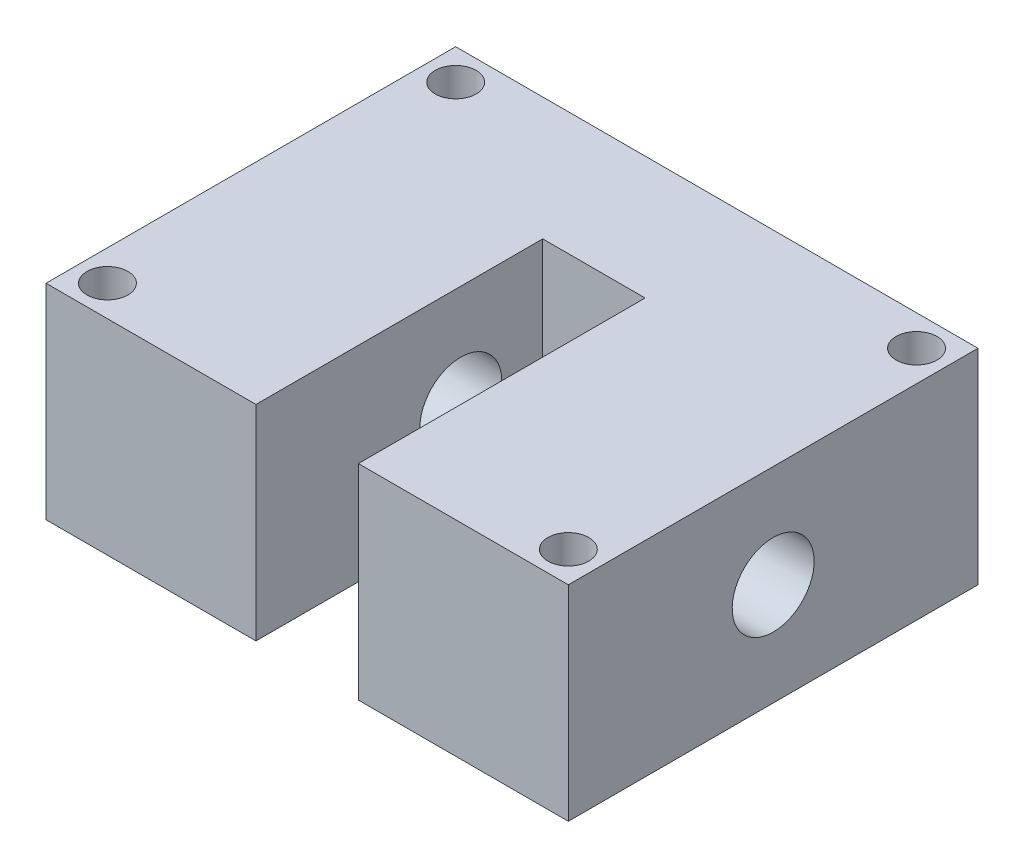
ISO-10303-21;
HEADER;
FILE_DESCRIPTION(('STEP AP214'),'2;1');
FILE_NAME('part.step','',(''),(''),'','','');
FILE_SCHEMA(('AUTOMOTIVE_DESIGN { 1 0 10303 214 1 1 1 1 }'));
ENDSEC;
DATA;
#1=APPLICATION_CONTEXT('core data for automotive mechanical design processes');
#2=APPLICATION_PROTOCOL_DEFINITION('international standard','automotive_design',2000,#1);
#3=PRODUCT_CONTEXT('',#1,'mechanical');
#4=PRODUCT('Part','Part','',(#3));
#5=PRODUCT_RELATED_PRODUCT_CATEGORY('part','',(#4));
#6=PRODUCT_DEFINITION_FORMATION('','',#4);
#7=PRODUCT_DEFINITION_CONTEXT('part definition',#1,'design');
#8=PRODUCT_DEFINITION('design','',#6,#7);
#9=PRODUCT_DEFINITION_SHAPE('','',#8);
#10=(LENGTH_UNIT() NAMED_UNIT(*) SI_UNIT(.MILLI.,.METRE.));
#11=(NAMED_UNIT(*) PLANE_ANGLE_UNIT() SI_UNIT($,.RADIAN.));
#12=(NAMED_UNIT(*) SI_UNIT($,.STERADIAN.) SOLID_ANGLE_UNIT());
#13=UNCERTAINTY_MEASURE_WITH_UNIT(LENGTH_MEASURE(1.E-05),#10,'distance_accuracy_value','');
#14=(GEOMETRIC_REPRESENTATION_CONTEXT(3) GLOBAL_UNCERTAINTY_ASSIGNED_CONTEXT((#13)) GLOBAL_UNIT_ASSIGNED_CONTEXT((#10,
#11,#12)) REPRESENTATION_CONTEXT('',''));
#15=CARTESIAN_POINT('',(0.,0.,0.));
#16=DIRECTION('',(0.,0.,1.));
#17=DIRECTION('',(1.,0.,0.));
#18=AXIS2_PLACEMENT_3D('',#15,#16,#17);
#19=CARTESIAN_POINT('',(0.,0.,20.));
#20=DIRECTION('',(0.,0.,1.));
#21=DIRECTION('',(1.,0.,0.));
#22=AXIS2_PLACEMENT_3D('',#19,#20,#21);
#23=PLANE('',#22);
#24=DIRECTION('',(0.,1.,0.));
#25=VECTOR('',#24,1.);
#26=CARTESIAN_POINT('',(5.,10.,20.));
#27=LINE('',#26,#25);
#28=CARTESIAN_POINT('',(5.,-10.,20.));
#29=VERTEX_POINT('',#28);
#30=CARTESIAN_POINT('',(5.,10.,20.));
#31=VERTEX_POINT('',#30);
#32=EDGE_CURVE('E115',#29,#31,#27,.T.);
#33=ORIENTED_EDGE('',*,*,#32,.F.);
#34=DIRECTION('',(1.,0.,0.));
#35=VECTOR('',#34,1.);
#36=CARTESIAN_POINT('',(-25.5,-10.,20.));
#37=LINE('',#36,#35);
#38=CARTESIAN_POINT('',(25.5,-10.,20.));
#39=VERTEX_POINT('',#38);
#40=EDGE_CURVE('E60',#29,#39,#37,.T.);
#41=ORIENTED_EDGE('',*,*,#40,.T.);
#42=DIRECTION('',(0.,1.,0.));
#43=VECTOR('',#42,1.);
#44=CARTESIAN_POINT('',(25.5,10.,20.));
#45=LINE('',#44,#43);
#46=CARTESIAN_POINT('',(25.5,10.,20.));
#47=VERTEX_POINT('',#46);
#48=EDGE_CURVE('E146',#39,#47,#45,.T.);
#49=ORIENTED_EDGE('',*,*,#48,.T.);
#50=DIRECTION('',(-1.,0.,0.));
#51=VECTOR('',#50,1.);
#52=CARTESIAN_POINT('',(-25.5,10.,20.));
#53=LINE('',#52,#51);
#54=EDGE_CURVE('E89',#47,#31,#53,.T.);
#55=ORIENTED_EDGE('',*,*,#54,.T.);
#56=EDGE_LOOP('',(#33,#41,#49,#55));
#57=FACE_BOUND('',#56,.T.);
#58=ADVANCED_FACE('F35',(#57),#23,.T.);
#59=CARTESIAN_POINT('',(25.5,10.,20.));
#60=DIRECTION('',(-1.,0.,0.));
#61=DIRECTION('',(0.,-1.,0.));
#62=AXIS2_PLACEMENT_3D('',#59,#60,#61);
#63=PLANE('',#62);
#64=CARTESIAN_POINT('',(25.5,0.,0.));
#65=DIRECTION('',(-1.,0.,0.));
#66=DIRECTION('',(0.,-1.,0.));
#67=AXIS2_PLACEMENT_3D('',#64,#65,#66);
#68=CIRCLE('',#67,4.);
#69=CARTESIAN_POINT('',(25.5,-4.,0.));
#70=VERTEX_POINT('',#69);
#71=EDGE_CURVE('E262',#70,#70,#68,.T.);
#72=ORIENTED_EDGE('',*,*,#71,.T.);
#73=EDGE_LOOP('',(#72));
#74=FACE_BOUND('',#73,.T.);
#75=DIRECTION('',(0.,1.,0.));
#76=VECTOR('',#75,1.);
#77=CARTESIAN_POINT('',(25.5,10.,-20.));
#78=LINE('',#77,#76);
#79=CARTESIAN_POINT('',(25.5,-10.,-20.));
#80=VERTEX_POINT('',#79);
#81=CARTESIAN_POINT('',(25.5,10.,-20.));
#82=VERTEX_POINT('',#81);
#83=EDGE_CURVE('E141',#80,#82,#78,.T.);
#84=ORIENTED_EDGE('',*,*,#83,.T.);
#85=DIRECTION('',(0.,0.,-1.));
#86=VECTOR('',#85,1.);
#87=CARTESIAN_POINT('',(25.5,10.,20.));
#88=LINE('',#87,#86);
#89=EDGE_CURVE('E11',#47,#82,#88,.T.);
#90=ORIENTED_EDGE('',*,*,#89,.F.);
#91=ORIENTED_EDGE('',*,*,#48,.F.);
#92=DIRECTION('',(0.,0.,-1.));
#93=VECTOR('',#92,1.);
#94=CARTESIAN_POINT('',(25.5,-10.,20.));
#95=LINE('',#94,#93);
#96=EDGE_CURVE('E155',#39,#80,#95,.T.);
#97=ORIENTED_EDGE('',*,*,#96,.T.);
#98=EDGE_LOOP('',(#84,#90,#91,#97));
#99=FACE_BOUND('',#98,.T.);
#100=ADVANCED_FACE('F37',(#74,#99),#63,.F.);
#101=CARTESIAN_POINT('',(-25.5,10.,20.));
#102=DIRECTION('',(0.,-1.,0.));
#103=DIRECTION('',(0.,0.,-1.));
#104=AXIS2_PLACEMENT_3D('',#101,#102,#103);
#105=PLANE('',#104);
#106=CARTESIAN_POINT('',(-22.5,10.,17.));
#107=DIRECTION('',(0.,1.,0.));
#108=DIRECTION('',(0.,0.,1.));
#109=AXIS2_PLACEMENT_3D('',#106,#107,#108);
#110=CIRCLE('',#109,2.);
#111=CARTESIAN_POINT('',(-22.5,10.,19.));
#112=VERTEX_POINT('',#111);
#113=EDGE_CURVE('E248',#112,#112,#110,.T.);
#114=ORIENTED_EDGE('',*,*,#113,.F.);
#115=EDGE_LOOP('',(#114));
#116=FACE_BOUND('',#115,.T.);
#117=CARTESIAN_POINT('',(22.5,10.,-17.));
#118=DIRECTION('',(0.,1.,0.));
#119=DIRECTION('',(0.,0.,1.));
#120=AXIS2_PLACEMENT_3D('',#117,#118,#119);
#121=CIRCLE('',#120,2.);
#122=CARTESIAN_POINT('',(22.5,10.,-15.));
#123=VERTEX_POINT('',#122);
#124=EDGE_CURVE('E241',#123,#123,#121,.T.);
#125=ORIENTED_EDGE('',*,*,#124,.F.);
#126=EDGE_LOOP('',(#125));
#127=FACE_BOUND('',#126,.T.);
#128=CARTESIAN_POINT('',(22.5,10.,17.));
#129=DIRECTION('',(0.,1.,0.));
#130=DIRECTION('',(0.,0.,1.));
#131=AXIS2_PLACEMENT_3D('',#128,#129,#130);
#132=CIRCLE('',#131,2.);
#133=CARTESIAN_POINT('',(22.5,10.,19.));
#134=VERTEX_POINT('',#133);
#135=EDGE_CURVE('E245',#134,#134,#132,.T.);
#136=ORIENTED_EDGE('',*,*,#135,.F.);
#137=EDGE_LOOP('',(#136));
#138=FACE_BOUND('',#137,.T.);
#139=CARTESIAN_POINT('',(-22.5,10.,-17.));
#140=DIRECTION('',(0.,1.,0.));
#141=DIRECTION('',(0.,0.,1.));
#142=AXIS2_PLACEMENT_3D('',#139,#140,#141);
#143=CIRCLE('',#142,2.);
#144=CARTESIAN_POINT('',(-22.5,10.,-15.));
#145=VERTEX_POINT('',#144);
#146=EDGE_CURVE('E256',#145,#145,#143,.T.);
#147=ORIENTED_EDGE('',*,*,#146,.F.);
#148=EDGE_LOOP('',(#147));
#149=FACE_BOUND('',#148,.T.);
#150=DIRECTION('',(-1.,0.,0.));
#151=VECTOR('',#150,1.);
#152=CARTESIAN_POINT('',(-5.,10.,-8.));
#153=LINE('',#152,#151);
#154=CARTESIAN_POINT('',(5.,10.,-8.));
#155=VERTEX_POINT('',#154);
#156=CARTESIAN_POINT('',(-5.,10.,-8.));
#157=VERTEX_POINT('',#156);
#158=EDGE_CURVE('E123',#155,#157,#153,.T.);
#159=ORIENTED_EDGE('',*,*,#158,.F.);
#160=DIRECTION('',(0.,0.,1.));
#161=VECTOR('',#160,1.);
#162=CARTESIAN_POINT('',(5.,10.,-8.));
#163=LINE('',#162,#161);
#164=EDGE_CURVE('E110',#155,#31,#163,.T.);
#165=ORIENTED_EDGE('',*,*,#164,.T.);
#166=ORIENTED_EDGE('',*,*,#54,.F.);
#167=ORIENTED_EDGE('',*,*,#89,.T.);
#168=DIRECTION('',(-1.,0.,0.));
#169=VECTOR('',#168,1.);
#170=CARTESIAN_POINT('',(-25.5,10.,-20.));
#171=LINE('',#170,#169);
#172=CARTESIAN_POINT('',(-25.5,10.,-20.));
#173=VERTEX_POINT('',#172);
#174=EDGE_CURVE('E158',#82,#173,#171,.T.);
#175=ORIENTED_EDGE('',*,*,#174,.T.);
#176=DIRECTION('',(0.,0.,-1.));
#177=VECTOR('',#176,1.);
#178=CARTESIAN_POINT('',(-25.5,10.,20.));
#179=LINE('',#178,#177);
#180=CARTESIAN_POINT('',(-25.5,10.,20.));
#181=VERTEX_POINT('',#180);
#182=EDGE_CURVE('E44',#181,#173,#179,.T.);
#183=ORIENTED_EDGE('',*,*,#182,.F.);
#184=CARTESIAN_POINT('',(-5.,10.,20.));
#185=VERTEX_POINT('',#184);
#186=EDGE_CURVE('E148',#185,#181,#53,.T.);
#187=ORIENTED_EDGE('',*,*,#186,.F.);
#188=DIRECTION('',(0.,0.,1.));
#189=VECTOR('',#188,1.);
#190=CARTESIAN_POINT('',(-5.,10.,-8.));
#191=LINE('',#190,#189);
#192=EDGE_CURVE('E51',#157,#185,#191,.T.);
#193=ORIENTED_EDGE('',*,*,#192,.F.);
#194=EDGE_LOOP('',(#159,#165,#166,#167,#175,#183,#187,#193));
#195=FACE_BOUND('',#194,.T.);
#196=ADVANCED_FACE('F128',(#116,#127,#138,#149,#195),#105,.F.);
#197=CARTESIAN_POINT('',(-25.5,10.,20.));
#198=DIRECTION('',(1.,0.,0.));
#199=DIRECTION('',(0.,1.,0.));
#200=AXIS2_PLACEMENT_3D('',#197,#198,#199);
#201=PLANE('',#200);
#202=CARTESIAN_POINT('',(-25.5,0.,0.));
#203=DIRECTION('',(1.,0.,0.));
#204=DIRECTION('',(0.,1.,0.));
#205=AXIS2_PLACEMENT_3D('',#202,#203,#204);
#206=CIRCLE('',#205,4.);
#207=CARTESIAN_POINT('',(-25.5,4.,0.));
#208=VERTEX_POINT('',#207);
#209=EDGE_CURVE('E137',#208,#208,#206,.T.);
#210=ORIENTED_EDGE('',*,*,#209,.T.);
#211=EDGE_LOOP('',(#210));
#212=FACE_BOUND('',#211,.T.);
#213=DIRECTION('',(0.,-1.,0.));
#214=VECTOR('',#213,1.);
#215=CARTESIAN_POINT('',(-25.5,10.,-20.));
#216=LINE('',#215,#214);
#217=CARTESIAN_POINT('',(-25.5,-10.,-20.));
#218=VERTEX_POINT('',#217);
#219=EDGE_CURVE('E160',#173,#218,#216,.T.);
#220=ORIENTED_EDGE('',*,*,#219,.T.);
#221=DIRECTION('',(0.,0.,-1.));
#222=VECTOR('',#221,1.);
#223=CARTESIAN_POINT('',(-25.5,-10.,20.));
#224=LINE('',#223,#222);
#225=CARTESIAN_POINT('',(-25.5,-10.,20.));
#226=VERTEX_POINT('',#225);
#227=EDGE_CURVE('E164',#226,#218,#224,.T.);
#228=ORIENTED_EDGE('',*,*,#227,.F.);
#229=DIRECTION('',(0.,-1.,0.));
#230=VECTOR('',#229,1.);
#231=CARTESIAN_POINT('',(-25.5,10.,20.));
#232=LINE('',#231,#230);
#233=EDGE_CURVE('E150',#181,#226,#232,.T.);
#234=ORIENTED_EDGE('',*,*,#233,.F.);
#235=ORIENTED_EDGE('',*,*,#182,.T.);
#236=EDGE_LOOP('',(#220,#228,#234,#235));
#237=FACE_BOUND('',#236,.T.);
#238=ADVANCED_FACE('F171',(#212,#237),#201,.F.);
#239=CARTESIAN_POINT('',(-25.5,-10.,20.));
#240=DIRECTION('',(0.,1.,0.));
#241=DIRECTION('',(0.,0.,1.));
#242=AXIS2_PLACEMENT_3D('',#239,#240,#241);
#243=PLANE('',#242);
#244=CARTESIAN_POINT('',(-22.5,-10.,17.));
#245=DIRECTION('',(0.,1.,0.));
#246=DIRECTION('',(0.,0.,1.));
#247=AXIS2_PLACEMENT_3D('',#244,#245,#246);
#248=CIRCLE('',#247,2.);
#249=CARTESIAN_POINT('',(-22.5,-10.,19.));
#250=VERTEX_POINT('',#249);
#251=EDGE_CURVE('E243',#250,#250,#248,.T.);
#252=ORIENTED_EDGE('',*,*,#251,.T.);
#253=EDGE_LOOP('',(#252));
#254=FACE_BOUND('',#253,.T.);
#255=CARTESIAN_POINT('',(22.5,-10.,-17.));
#256=DIRECTION('',(0.,1.,0.));
#257=DIRECTION('',(0.,0.,1.));
#258=AXIS2_PLACEMENT_3D('',#255,#256,#257);
#259=CIRCLE('',#258,2.);
#260=CARTESIAN_POINT('',(22.5,-10.,-15.));
#261=VERTEX_POINT('',#260);
#262=EDGE_CURVE('E238',#261,#261,#259,.T.);
#263=ORIENTED_EDGE('',*,*,#262,.T.);
#264=EDGE_LOOP('',(#263));
#265=FACE_BOUND('',#264,.T.);
#266=CARTESIAN_POINT('',(22.5,-10.,17.));
#267=DIRECTION('',(0.,1.,0.));
#268=DIRECTION('',(0.,0.,1.));
#269=AXIS2_PLACEMENT_3D('',#266,#267,#268);
#270=CIRCLE('',#269,2.);
#271=CARTESIAN_POINT('',(22.5,-10.,19.));
#272=VERTEX_POINT('',#271);
#273=EDGE_CURVE('E253',#272,#272,#270,.T.);
#274=ORIENTED_EDGE('',*,*,#273,.T.);
#275=EDGE_LOOP('',(#274));
#276=FACE_BOUND('',#275,.T.);
#277=CARTESIAN_POINT('',(-22.5,-10.,-17.));
#278=DIRECTION('',(0.,1.,0.));
#279=DIRECTION('',(0.,0.,1.));
#280=AXIS2_PLACEMENT_3D('',#277,#278,#279);
#281=CIRCLE('',#280,2.);
#282=CARTESIAN_POINT('',(-22.5,-10.,-15.));
#283=VERTEX_POINT('',#282);
#284=EDGE_CURVE('E259',#283,#283,#281,.T.);
#285=ORIENTED_EDGE('',*,*,#284,.T.);
#286=EDGE_LOOP('',(#285));
#287=FACE_BOUND('',#286,.T.);
#288=ORIENTED_EDGE('',*,*,#40,.F.);
#289=DIRECTION('',(0.,0.,1.));
#290=VECTOR('',#289,1.);
#291=CARTESIAN_POINT('',(5.,-10.,-8.));
#292=LINE('',#291,#290);
#293=CARTESIAN_POINT('',(5.,-10.,-8.));
#294=VERTEX_POINT('',#293);
#295=EDGE_CURVE('E139',#294,#29,#292,.T.);
#296=ORIENTED_EDGE('',*,*,#295,.F.);
#297=DIRECTION('',(1.,0.,0.));
#298=VECTOR('',#297,1.);
#299=CARTESIAN_POINT('',(-5.,-10.,-8.));
#300=LINE('',#299,#298);
#301=CARTESIAN_POINT('',(-5.,-10.,-8.));
#302=VERTEX_POINT('',#301);
#303=EDGE_CURVE('E117',#302,#294,#300,.T.);
#304=ORIENTED_EDGE('',*,*,#303,.F.);
#305=DIRECTION('',(0.,0.,1.));
#306=VECTOR('',#305,1.);
#307=CARTESIAN_POINT('',(-5.,-10.,-8.));
#308=LINE('',#307,#306);
#309=CARTESIAN_POINT('',(-5.,-10.,20.));
#310=VERTEX_POINT('',#309);
#311=EDGE_CURVE('E142',#302,#310,#308,.T.);
#312=ORIENTED_EDGE('',*,*,#311,.T.);
#313=EDGE_CURVE('E152',#226,#310,#37,.T.);
#314=ORIENTED_EDGE('',*,*,#313,.F.);
#315=ORIENTED_EDGE('',*,*,#227,.T.);
#316=DIRECTION('',(1.,0.,0.));
#317=VECTOR('',#316,1.);
#318=CARTESIAN_POINT('',(-25.5,-10.,-20.));
#319=LINE('',#318,#317);
#320=EDGE_CURVE('E82',#218,#80,#319,.T.);
#321=ORIENTED_EDGE('',*,*,#320,.T.);
#322=ORIENTED_EDGE('',*,*,#96,.F.);
#323=EDGE_LOOP('',(#288,#296,#304,#312,#314,#315,#321,#322));
#324=FACE_BOUND('',#323,.T.);
#325=ADVANCED_FACE('F179',(#254,#265,#276,#287,#324),#243,.F.);
#326=DIRECTION('',(0.,-1.,0.));
#327=VECTOR('',#326,1.);
#328=CARTESIAN_POINT('',(-5.,10.,20.));
#329=LINE('',#328,#327);
#330=EDGE_CURVE('E126',#185,#310,#329,.T.);
#331=ORIENTED_EDGE('',*,*,#330,.F.);
#332=ORIENTED_EDGE('',*,*,#186,.T.);
#333=ORIENTED_EDGE('',*,*,#233,.T.);
#334=ORIENTED_EDGE('',*,*,#313,.T.);
#335=EDGE_LOOP('',(#331,#332,#333,#334));
#336=FACE_BOUND('',#335,.T.);
#337=ADVANCED_FACE('F182',(#336),#23,.T.);
#338=CARTESIAN_POINT('',(0.,0.,-20.));
#339=DIRECTION('',(0.,0.,1.));
#340=DIRECTION('',(1.,0.,0.));
#341=AXIS2_PLACEMENT_3D('',#338,#339,#340);
#342=PLANE('',#341);
#343=ORIENTED_EDGE('',*,*,#83,.F.);
#344=ORIENTED_EDGE('',*,*,#320,.F.);
#345=ORIENTED_EDGE('',*,*,#219,.F.);
#346=ORIENTED_EDGE('',*,*,#174,.F.);
#347=EDGE_LOOP('',(#343,#344,#345,#346));
#348=FACE_BOUND('',#347,.T.);
#349=ADVANCED_FACE('F175',(#348),#342,.F.);
#350=CARTESIAN_POINT('',(5.,10.,-8.));
#351=DIRECTION('',(1.,0.,0.));
#352=DIRECTION('',(0.,1.,0.));
#353=AXIS2_PLACEMENT_3D('',#350,#351,#352);
#354=PLANE('',#353);
#355=CARTESIAN_POINT('',(5.,0.,0.));
#356=DIRECTION('',(1.,0.,0.));
#357=DIRECTION('',(0.,1.,0.));
#358=AXIS2_PLACEMENT_3D('',#355,#356,#357);
#359=CIRCLE('',#358,4.);
#360=CARTESIAN_POINT('',(5.,4.,0.));
#361=VERTEX_POINT('',#360);
#362=EDGE_CURVE('E267',#361,#361,#359,.T.);
#363=ORIENTED_EDGE('',*,*,#362,.T.);
#364=EDGE_LOOP('',(#363));
#365=FACE_BOUND('',#364,.T.);
#366=ORIENTED_EDGE('',*,*,#32,.T.);
#367=ORIENTED_EDGE('',*,*,#164,.F.);
#368=DIRECTION('',(0.,1.,0.));
#369=VECTOR('',#368,1.);
#370=CARTESIAN_POINT('',(5.,10.,-8.));
#371=LINE('',#370,#369);
#372=EDGE_CURVE('E113',#294,#155,#371,.T.);
#373=ORIENTED_EDGE('',*,*,#372,.F.);
#374=ORIENTED_EDGE('',*,*,#295,.T.);
#375=EDGE_LOOP('',(#366,#367,#373,#374));
#376=FACE_BOUND('',#375,.T.);
#377=ADVANCED_FACE('F112',(#365,#376),#354,.F.);
#378=CARTESIAN_POINT('',(-5.,10.,-8.));
#379=DIRECTION('',(-1.,0.,0.));
#380=DIRECTION('',(0.,-1.,0.));
#381=AXIS2_PLACEMENT_3D('',#378,#379,#380);
#382=PLANE('',#381);
#383=CARTESIAN_POINT('',(-5.,0.,0.));
#384=DIRECTION('',(-1.,0.,0.));
#385=DIRECTION('',(0.,-1.,0.));
#386=AXIS2_PLACEMENT_3D('',#383,#384,#385);
#387=CIRCLE('',#386,4.);
#388=CARTESIAN_POINT('',(-5.,-4.,0.));
#389=VERTEX_POINT('',#388);
#390=EDGE_CURVE('E39',#389,#389,#387,.T.);
#391=ORIENTED_EDGE('',*,*,#390,.T.);
#392=EDGE_LOOP('',(#391));
#393=FACE_BOUND('',#392,.T.);
#394=ORIENTED_EDGE('',*,*,#330,.T.);
#395=ORIENTED_EDGE('',*,*,#311,.F.);
#396=DIRECTION('',(0.,-1.,0.));
#397=VECTOR('',#396,1.);
#398=CARTESIAN_POINT('',(-5.,10.,-8.));
#399=LINE('',#398,#397);
#400=EDGE_CURVE('E130',#157,#302,#399,.T.);
#401=ORIENTED_EDGE('',*,*,#400,.F.);
#402=ORIENTED_EDGE('',*,*,#192,.T.);
#403=EDGE_LOOP('',(#394,#395,#401,#402));
#404=FACE_BOUND('',#403,.T.);
#405=ADVANCED_FACE('F200',(#393,#404),#382,.F.);
#406=CARTESIAN_POINT('',(0.,0.,-8.));
#407=DIRECTION('',(0.,0.,1.));
#408=DIRECTION('',(1.,0.,0.));
#409=AXIS2_PLACEMENT_3D('',#406,#407,#408);
#410=PLANE('',#409);
#411=ORIENTED_EDGE('',*,*,#372,.T.);
#412=ORIENTED_EDGE('',*,*,#158,.T.);
#413=ORIENTED_EDGE('',*,*,#400,.T.);
#414=ORIENTED_EDGE('',*,*,#303,.T.);
#415=EDGE_LOOP('',(#411,#412,#413,#414));
#416=FACE_BOUND('',#415,.T.);
#417=ADVANCED_FACE('F121',(#416),#410,.T.);
#418=CARTESIAN_POINT('',(25.5,0.,0.));
#419=DIRECTION('',(-1.,0.,0.));
#420=DIRECTION('',(0.,-1.,0.));
#421=AXIS2_PLACEMENT_3D('',#418,#419,#420);
#422=CYLINDRICAL_SURFACE('',#421,4.);
#423=ORIENTED_EDGE('',*,*,#390,.F.);
#424=EDGE_LOOP('',(#423));
#425=FACE_BOUND('',#424,.T.);
#426=ORIENTED_EDGE('',*,*,#209,.F.);
#427=EDGE_LOOP('',(#426));
#428=FACE_BOUND('',#427,.T.);
#429=ADVANCED_FACE('F209',(#425,#428),#422,.F.);
#430=ORIENTED_EDGE('',*,*,#71,.F.);
#431=EDGE_LOOP('',(#430));
#432=FACE_BOUND('',#431,.T.);
#433=ORIENTED_EDGE('',*,*,#362,.F.);
#434=EDGE_LOOP('',(#433));
#435=FACE_BOUND('',#434,.T.);
#436=ADVANCED_FACE('F216',(#432,#435),#422,.F.);
#437=CARTESIAN_POINT('',(-22.5,-10.,-17.));
#438=DIRECTION('',(0.,1.,0.));
#439=DIRECTION('',(0.,0.,1.));
#440=AXIS2_PLACEMENT_3D('',#437,#438,#439);
#441=CYLINDRICAL_SURFACE('',#440,2.);
#442=ORIENTED_EDGE('',*,*,#284,.F.);
#443=EDGE_LOOP('',(#442));
#444=FACE_BOUND('',#443,.T.);
#445=ORIENTED_EDGE('',*,*,#146,.T.);
#446=EDGE_LOOP('',(#445));
#447=FACE_BOUND('',#446,.T.);
#448=ADVANCED_FACE('F218',(#444,#447),#441,.F.);
#449=CARTESIAN_POINT('',(22.5,-10.,17.));
#450=DIRECTION('',(0.,1.,0.));
#451=DIRECTION('',(0.,0.,1.));
#452=AXIS2_PLACEMENT_3D('',#449,#450,#451);
#453=CYLINDRICAL_SURFACE('',#452,2.);
#454=ORIENTED_EDGE('',*,*,#273,.F.);
#455=EDGE_LOOP('',(#454));
#456=FACE_BOUND('',#455,.T.);
#457=ORIENTED_EDGE('',*,*,#135,.T.);
#458=EDGE_LOOP('',(#457));
#459=FACE_BOUND('',#458,.T.);
#460=ADVANCED_FACE('F221',(#456,#459),#453,.F.);
#461=CARTESIAN_POINT('',(22.5,-10.,-17.));
#462=DIRECTION('',(0.,1.,0.));
#463=DIRECTION('',(0.,0.,1.));
#464=AXIS2_PLACEMENT_3D('',#461,#462,#463);
#465=CYLINDRICAL_SURFACE('',#464,2.);
#466=ORIENTED_EDGE('',*,*,#262,.F.);
#467=EDGE_LOOP('',(#466));
#468=FACE_BOUND('',#467,.T.);
#469=ORIENTED_EDGE('',*,*,#124,.T.);
#470=EDGE_LOOP('',(#469));
#471=FACE_BOUND('',#470,.T.);
#472=ADVANCED_FACE('F225',(#468,#471),#465,.F.);
#473=CARTESIAN_POINT('',(-22.5,-10.,17.));
#474=DIRECTION('',(0.,1.,0.));
#475=DIRECTION('',(0.,0.,1.));
#476=AXIS2_PLACEMENT_3D('',#473,#474,#475);
#477=CYLINDRICAL_SURFACE('',#476,2.);
#478=ORIENTED_EDGE('',*,*,#251,.F.);
#479=EDGE_LOOP('',(#478));
#480=FACE_BOUND('',#479,.T.);
#481=ORIENTED_EDGE('',*,*,#113,.T.);
#482=EDGE_LOOP('',(#481));
#483=FACE_BOUND('',#482,.T.);
#484=ADVANCED_FACE('F227',(#480,#483),#477,.F.);
#485=CLOSED_SHELL('',(#58,#100,#196,#238,#325,#337,#349,#377,#405,#417,#429,#436,#448,#460,#472,#484));
#486=MANIFOLD_SOLID_BREP('B2',#485);
#487=ADVANCED_BREP_SHAPE_REPRESENTATION('',(#18,#486),#14);
#488=SHAPE_DEFINITION_REPRESENTATION(#9,#487);
ENDSEC;
END-ISO-10303-21;
